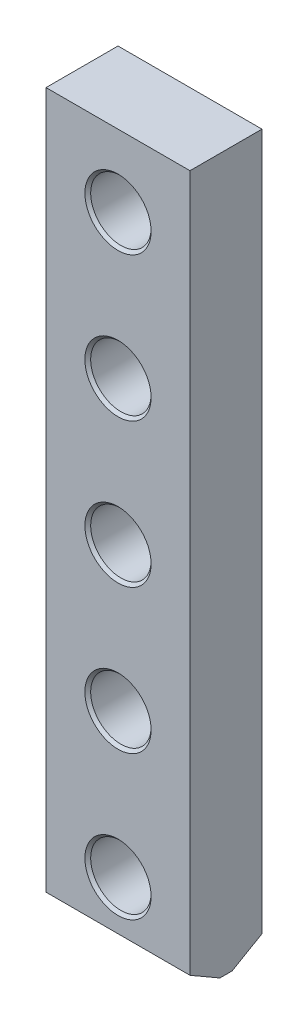
ISO-10303-21;
HEADER;
FILE_DESCRIPTION(('STEP AP214'),'2;1');
FILE_NAME('part.step','',(''),(''),'','','');
FILE_SCHEMA(('AUTOMOTIVE_DESIGN { 1 0 10303 214 1 1 1 1 }'));
ENDSEC;
DATA;
#1=APPLICATION_CONTEXT('core data for automotive mechanical design processes');
#2=APPLICATION_PROTOCOL_DEFINITION('international standard','automotive_design',2000,#1);
#3=PRODUCT_CONTEXT('',#1,'mechanical');
#4=PRODUCT('Part','Part','',(#3));
#5=PRODUCT_RELATED_PRODUCT_CATEGORY('part','',(#4));
#6=PRODUCT_DEFINITION_FORMATION('','',#4);
#7=PRODUCT_DEFINITION_CONTEXT('part definition',#1,'design');
#8=PRODUCT_DEFINITION('design','',#6,#7);
#9=PRODUCT_DEFINITION_SHAPE('','',#8);
#10=(LENGTH_UNIT() NAMED_UNIT(*) SI_UNIT(.MILLI.,.METRE.));
#11=(NAMED_UNIT(*) PLANE_ANGLE_UNIT() SI_UNIT($,.RADIAN.));
#12=(NAMED_UNIT(*) SI_UNIT($,.STERADIAN.) SOLID_ANGLE_UNIT());
#13=UNCERTAINTY_MEASURE_WITH_UNIT(LENGTH_MEASURE(1.E-05),#10,'distance_accuracy_value','');
#14=(GEOMETRIC_REPRESENTATION_CONTEXT(3) GLOBAL_UNCERTAINTY_ASSIGNED_CONTEXT((#13)) GLOBAL_UNIT_ASSIGNED_CONTEXT((#10,
#11,#12)) REPRESENTATION_CONTEXT('',''));
#15=CARTESIAN_POINT('',(0.,0.,0.));
#16=DIRECTION('',(0.,0.,1.));
#17=DIRECTION('',(1.,0.,0.));
#18=AXIS2_PLACEMENT_3D('',#15,#16,#17);
#19=CARTESIAN_POINT('',(0.,0.,25.));
#20=DIRECTION('',(1.,0.,0.));
#21=DIRECTION('',(0.,1.,0.));
#22=AXIS2_PLACEMENT_3D('',#19,#20,#21);
#23=PLANE('',#22);
#24=DIRECTION('',(0.,0.,-1.));
#25=VECTOR('',#24,1.);
#26=CARTESIAN_POINT('',(0.,0.,25.));
#27=LINE('',#26,#25);
#28=CARTESIAN_POINT('',(0.,0.,14.6076951545867));
#29=VERTEX_POINT('',#28);
#30=CARTESIAN_POINT('',(0.,0.,10.3923048454133));
#31=VERTEX_POINT('',#30);
#32=EDGE_CURVE('E371',#29,#31,#27,.T.);
#33=ORIENTED_EDGE('',*,*,#32,.F.);
#34=DIRECTION('',(0.,-0.500000000000002,-0.866025403784437));
#35=VECTOR('',#34,1.);
#36=CARTESIAN_POINT('',(0.,6.00000000000003,25.));
#37=LINE('',#36,#35);
#38=CARTESIAN_POINT('',(0.,6.00000000000003,25.));
#39=VERTEX_POINT('',#38);
#40=EDGE_CURVE('E386',#29,#39,#37,.F.);
#41=ORIENTED_EDGE('',*,*,#40,.T.);
#42=DIRECTION('',(0.,-1.,0.));
#43=VECTOR('',#42,1.);
#44=CARTESIAN_POINT('',(0.,0.,25.));
#45=LINE('',#44,#43);
#46=CARTESIAN_POINT('',(0.,248.,25.));
#47=VERTEX_POINT('',#46);
#48=EDGE_CURVE('E345',#47,#39,#45,.T.);
#49=ORIENTED_EDGE('',*,*,#48,.F.);
#50=DIRECTION('',(0.,0.,-1.));
#51=VECTOR('',#50,1.);
#52=CARTESIAN_POINT('',(0.,248.,25.));
#53=LINE('',#52,#51);
#54=CARTESIAN_POINT('',(0.,248.,0.));
#55=VERTEX_POINT('',#54);
#56=EDGE_CURVE('E355',#47,#55,#53,.T.);
#57=ORIENTED_EDGE('',*,*,#56,.T.);
#58=DIRECTION('',(0.,-1.,0.));
#59=VECTOR('',#58,1.);
#60=CARTESIAN_POINT('',(0.,0.,0.));
#61=LINE('',#60,#59);
#62=CARTESIAN_POINT('',(0.,6.00000000000003,0.));
#63=VERTEX_POINT('',#62);
#64=EDGE_CURVE('E364',#55,#63,#61,.T.);
#65=ORIENTED_EDGE('',*,*,#64,.T.);
#66=DIRECTION('',(0.,-0.500000000000002,0.866025403784437));
#67=VECTOR('',#66,1.);
#68=CARTESIAN_POINT('',(0.,0.,10.3923048454133));
#69=LINE('',#68,#67);
#70=EDGE_CURVE('E380',#63,#31,#69,.T.);
#71=ORIENTED_EDGE('',*,*,#70,.T.);
#72=EDGE_LOOP('',(#33,#41,#49,#57,#65,#71));
#73=FACE_BOUND('',#72,.T.);
#74=ADVANCED_FACE('F284',(#73),#23,.F.);
#75=CARTESIAN_POINT('',(0.,0.,25.));
#76=DIRECTION('',(0.,1.,0.));
#77=DIRECTION('',(-1.,0.,0.));
#78=AXIS2_PLACEMENT_3D('',#75,#76,#77);
#79=PLANE('',#78);
#80=DIRECTION('',(0.,0.,-1.));
#81=VECTOR('',#80,1.);
#82=CARTESIAN_POINT('',(50.0000000000001,0.,25.));
#83=LINE('',#82,#81);
#84=CARTESIAN_POINT('',(50.0000000000001,0.,14.6076951545867));
#85=VERTEX_POINT('',#84);
#86=CARTESIAN_POINT('',(50.0000000000001,0.,10.3923048454133));
#87=VERTEX_POINT('',#86);
#88=EDGE_CURVE('E354',#85,#87,#83,.T.);
#89=ORIENTED_EDGE('',*,*,#88,.F.);
#90=DIRECTION('',(-1.,0.,0.));
#91=VECTOR('',#90,1.);
#92=CARTESIAN_POINT('',(0.,0.,14.6076951545867));
#93=LINE('',#92,#91);
#94=EDGE_CURVE('E299',#85,#29,#93,.T.);
#95=ORIENTED_EDGE('',*,*,#94,.T.);
#96=ORIENTED_EDGE('',*,*,#32,.T.);
#97=DIRECTION('',(1.,0.,0.));
#98=VECTOR('',#97,1.);
#99=CARTESIAN_POINT('',(50.0000000000001,0.,10.3923048454133));
#100=LINE('',#99,#98);
#101=EDGE_CURVE('E373',#31,#87,#100,.T.);
#102=ORIENTED_EDGE('',*,*,#101,.T.);
#103=EDGE_LOOP('',(#89,#95,#96,#102));
#104=FACE_BOUND('',#103,.T.);
#105=ADVANCED_FACE('F471',(#104),#79,.F.);
#106=CARTESIAN_POINT('',(50.0000000000001,0.,25.));
#107=DIRECTION('',(-1.,0.,0.));
#108=DIRECTION('',(0.,-1.,0.));
#109=AXIS2_PLACEMENT_3D('',#106,#107,#108);
#110=PLANE('',#109);
#111=DIRECTION('',(0.,1.,0.));
#112=VECTOR('',#111,1.);
#113=CARTESIAN_POINT('',(50.0000000000001,0.,25.));
#114=LINE('',#113,#112);
#115=CARTESIAN_POINT('',(50.0000000000001,6.00000000000004,25.));
#116=VERTEX_POINT('',#115);
#117=CARTESIAN_POINT('',(50.,248.,25.));
#118=VERTEX_POINT('',#117);
#119=EDGE_CURVE('E336',#116,#118,#114,.T.);
#120=ORIENTED_EDGE('',*,*,#119,.F.);
#121=DIRECTION('',(0.,0.500000000000002,0.866025403784437));
#122=VECTOR('',#121,1.);
#123=CARTESIAN_POINT('',(50.0000000000001,6.00000000000004,25.));
#124=LINE('',#123,#122);
#125=EDGE_CURVE('E307',#116,#85,#124,.F.);
#126=ORIENTED_EDGE('',*,*,#125,.T.);
#127=ORIENTED_EDGE('',*,*,#88,.T.);
#128=DIRECTION('',(0.,0.500000000000002,-0.866025403784437));
#129=VECTOR('',#128,1.);
#130=CARTESIAN_POINT('',(50.0000000000001,0.,10.3923048454133));
#131=LINE('',#130,#129);
#132=CARTESIAN_POINT('',(50.0000000000001,6.00000000000004,0.));
#133=VERTEX_POINT('',#132);
#134=EDGE_CURVE('E376',#87,#133,#131,.T.);
#135=ORIENTED_EDGE('',*,*,#134,.T.);
#136=DIRECTION('',(0.,1.,0.));
#137=VECTOR('',#136,1.);
#138=CARTESIAN_POINT('',(50.0000000000001,0.,0.));
#139=LINE('',#138,#137);
#140=CARTESIAN_POINT('',(50.,248.,0.));
#141=VERTEX_POINT('',#140);
#142=EDGE_CURVE('E351',#133,#141,#139,.T.);
#143=ORIENTED_EDGE('',*,*,#142,.T.);
#144=DIRECTION('',(0.,0.,-1.));
#145=VECTOR('',#144,1.);
#146=CARTESIAN_POINT('',(50.,248.,25.));
#147=LINE('',#146,#145);
#148=EDGE_CURVE('E348',#118,#141,#147,.T.);
#149=ORIENTED_EDGE('',*,*,#148,.F.);
#150=EDGE_LOOP('',(#120,#126,#127,#135,#143,#149));
#151=FACE_BOUND('',#150,.T.);
#152=ADVANCED_FACE('F349',(#151),#110,.F.);
#153=CARTESIAN_POINT('',(0.,248.,25.));
#154=DIRECTION('',(0.,-1.,0.));
#155=DIRECTION('',(0.,0.,-1.));
#156=AXIS2_PLACEMENT_3D('',#153,#154,#155);
#157=PLANE('',#156);
#158=DIRECTION('',(-1.,0.,0.));
#159=VECTOR('',#158,1.);
#160=CARTESIAN_POINT('',(0.,248.,0.));
#161=LINE('',#160,#159);
#162=EDGE_CURVE('E368',#141,#55,#161,.T.);
#163=ORIENTED_EDGE('',*,*,#162,.T.);
#164=ORIENTED_EDGE('',*,*,#56,.F.);
#165=DIRECTION('',(-1.,0.,0.));
#166=VECTOR('',#165,1.);
#167=CARTESIAN_POINT('',(0.,248.,25.));
#168=LINE('',#167,#166);
#169=EDGE_CURVE('E341',#118,#47,#168,.T.);
#170=ORIENTED_EDGE('',*,*,#169,.F.);
#171=ORIENTED_EDGE('',*,*,#148,.T.);
#172=EDGE_LOOP('',(#163,#164,#170,#171));
#173=FACE_BOUND('',#172,.T.);
#174=ADVANCED_FACE('F357',(#173),#157,.F.);
#175=CARTESIAN_POINT('',(0.,0.,25.));
#176=DIRECTION('',(0.,0.,-1.));
#177=DIRECTION('',(-1.,0.,0.));
#178=AXIS2_PLACEMENT_3D('',#175,#176,#177);
#179=PLANE('',#178);
#180=CARTESIAN_POINT('',(25.0000000000001,23.,25.));
#181=DIRECTION('',(0.,0.,-1.));
#182=DIRECTION('',(-1.,0.,0.));
#183=AXIS2_PLACEMENT_3D('',#180,#181,#182);
#184=CIRCLE('',#183,11.5);
#185=CARTESIAN_POINT('',(13.5000000000001,23.,25.));
#186=VERTEX_POINT('',#185);
#187=EDGE_CURVE('E12',#186,#186,#184,.T.);
#188=ORIENTED_EDGE('',*,*,#187,.T.);
#189=EDGE_LOOP('',(#188));
#190=FACE_BOUND('',#189,.T.);
#191=CARTESIAN_POINT('',(25.0000000000001,73.,25.));
#192=DIRECTION('',(0.,0.,-1.));
#193=DIRECTION('',(-1.,0.,0.));
#194=AXIS2_PLACEMENT_3D('',#191,#192,#193);
#195=CIRCLE('',#194,11.5);
#196=CARTESIAN_POINT('',(13.5000000000001,73.,25.));
#197=VERTEX_POINT('',#196);
#198=EDGE_CURVE('E292',#197,#197,#195,.T.);
#199=ORIENTED_EDGE('',*,*,#198,.T.);
#200=EDGE_LOOP('',(#199));
#201=FACE_BOUND('',#200,.T.);
#202=CARTESIAN_POINT('',(25.0000000000001,223.,25.));
#203=DIRECTION('',(0.,0.,-1.));
#204=DIRECTION('',(-1.,0.,0.));
#205=AXIS2_PLACEMENT_3D('',#202,#203,#204);
#206=CIRCLE('',#205,11.5);
#207=CARTESIAN_POINT('',(13.5000000000001,223.,25.));
#208=VERTEX_POINT('',#207);
#209=EDGE_CURVE('E439',#208,#208,#206,.T.);
#210=ORIENTED_EDGE('',*,*,#209,.T.);
#211=EDGE_LOOP('',(#210));
#212=FACE_BOUND('',#211,.T.);
#213=CARTESIAN_POINT('',(25.0000000000001,173.,25.));
#214=DIRECTION('',(0.,0.,-1.));
#215=DIRECTION('',(-1.,0.,0.));
#216=AXIS2_PLACEMENT_3D('',#213,#214,#215);
#217=CIRCLE('',#216,11.5);
#218=CARTESIAN_POINT('',(13.5000000000001,173.,25.));
#219=VERTEX_POINT('',#218);
#220=EDGE_CURVE('E436',#219,#219,#217,.T.);
#221=ORIENTED_EDGE('',*,*,#220,.T.);
#222=EDGE_LOOP('',(#221));
#223=FACE_BOUND('',#222,.T.);
#224=CARTESIAN_POINT('',(25.0000000000001,123.,25.));
#225=DIRECTION('',(0.,0.,-1.));
#226=DIRECTION('',(-1.,0.,0.));
#227=AXIS2_PLACEMENT_3D('',#224,#225,#226);
#228=CIRCLE('',#227,11.5);
#229=CARTESIAN_POINT('',(13.5000000000001,123.,25.));
#230=VERTEX_POINT('',#229);
#231=EDGE_CURVE('E433',#230,#230,#228,.T.);
#232=ORIENTED_EDGE('',*,*,#231,.T.);
#233=EDGE_LOOP('',(#232));
#234=FACE_BOUND('',#233,.T.);
#235=ORIENTED_EDGE('',*,*,#48,.T.);
#236=DIRECTION('',(1.,0.,0.));
#237=VECTOR('',#236,1.);
#238=CARTESIAN_POINT('',(0.,6.00000000000003,25.));
#239=LINE('',#238,#237);
#240=EDGE_CURVE('E344',#39,#116,#239,.T.);
#241=ORIENTED_EDGE('',*,*,#240,.T.);
#242=ORIENTED_EDGE('',*,*,#119,.T.);
#243=ORIENTED_EDGE('',*,*,#169,.T.);
#244=EDGE_LOOP('',(#235,#241,#242,#243));
#245=FACE_BOUND('',#244,.T.);
#246=ADVANCED_FACE('F339',(#190,#201,#212,#223,#234,#245),#179,.F.);
#247=CARTESIAN_POINT('',(0.,0.,0.));
#248=DIRECTION('',(0.,0.,-1.));
#249=DIRECTION('',(-1.,0.,0.));
#250=AXIS2_PLACEMENT_3D('',#247,#248,#249);
#251=PLANE('',#250);
#252=CARTESIAN_POINT('',(25.0000000000001,223.,0.));
#253=DIRECTION('',(0.,0.,-1.));
#254=DIRECTION('',(-1.,0.,0.));
#255=AXIS2_PLACEMENT_3D('',#252,#253,#254);
#256=CIRCLE('',#255,11.5);
#257=CARTESIAN_POINT('',(13.5000000000001,223.,0.));
#258=VERTEX_POINT('',#257);
#259=EDGE_CURVE('E400',#258,#258,#256,.F.);
#260=ORIENTED_EDGE('',*,*,#259,.T.);
#261=EDGE_LOOP('',(#260));
#262=FACE_BOUND('',#261,.T.);
#263=CARTESIAN_POINT('',(25.0000000000001,23.,0.));
#264=DIRECTION('',(0.,0.,-1.));
#265=DIRECTION('',(-1.,0.,0.));
#266=AXIS2_PLACEMENT_3D('',#263,#264,#265);
#267=CIRCLE('',#266,11.5);
#268=CARTESIAN_POINT('',(13.5000000000001,23.,0.));
#269=VERTEX_POINT('',#268);
#270=EDGE_CURVE('E397',#269,#269,#267,.F.);
#271=ORIENTED_EDGE('',*,*,#270,.T.);
#272=EDGE_LOOP('',(#271));
#273=FACE_BOUND('',#272,.T.);
#274=CARTESIAN_POINT('',(25.0000000000001,73.,0.));
#275=DIRECTION('',(0.,0.,-1.));
#276=DIRECTION('',(-1.,0.,0.));
#277=AXIS2_PLACEMENT_3D('',#274,#275,#276);
#278=CIRCLE('',#277,11.5);
#279=CARTESIAN_POINT('',(13.5000000000001,73.,0.));
#280=VERTEX_POINT('',#279);
#281=EDGE_CURVE('E394',#280,#280,#278,.F.);
#282=ORIENTED_EDGE('',*,*,#281,.T.);
#283=EDGE_LOOP('',(#282));
#284=FACE_BOUND('',#283,.T.);
#285=CARTESIAN_POINT('',(25.0000000000001,123.,0.));
#286=DIRECTION('',(0.,0.,-1.));
#287=DIRECTION('',(-1.,0.,0.));
#288=AXIS2_PLACEMENT_3D('',#285,#286,#287);
#289=CIRCLE('',#288,11.5);
#290=CARTESIAN_POINT('',(13.5000000000001,123.,0.));
#291=VERTEX_POINT('',#290);
#292=EDGE_CURVE('E391',#291,#291,#289,.F.);
#293=ORIENTED_EDGE('',*,*,#292,.T.);
#294=EDGE_LOOP('',(#293));
#295=FACE_BOUND('',#294,.T.);
#296=CARTESIAN_POINT('',(25.0000000000001,173.,0.));
#297=DIRECTION('',(0.,0.,-1.));
#298=DIRECTION('',(-1.,0.,0.));
#299=AXIS2_PLACEMENT_3D('',#296,#297,#298);
#300=CIRCLE('',#299,11.5);
#301=CARTESIAN_POINT('',(13.5000000000001,173.,0.));
#302=VERTEX_POINT('',#301);
#303=EDGE_CURVE('E388',#302,#302,#300,.F.);
#304=ORIENTED_EDGE('',*,*,#303,.T.);
#305=EDGE_LOOP('',(#304));
#306=FACE_BOUND('',#305,.T.);
#307=ORIENTED_EDGE('',*,*,#142,.F.);
#308=DIRECTION('',(-1.,0.,0.));
#309=VECTOR('',#308,1.);
#310=CARTESIAN_POINT('',(0.,6.00000000000003,0.));
#311=LINE('',#310,#309);
#312=EDGE_CURVE('E378',#133,#63,#311,.T.);
#313=ORIENTED_EDGE('',*,*,#312,.T.);
#314=ORIENTED_EDGE('',*,*,#64,.F.);
#315=ORIENTED_EDGE('',*,*,#162,.F.);
#316=EDGE_LOOP('',(#307,#313,#314,#315));
#317=FACE_BOUND('',#316,.T.);
#318=ADVANCED_FACE('F532',(#262,#273,#284,#295,#306,#317),#251,.T.);
#319=CARTESIAN_POINT('',(25.0000000000001,23.,0.));
#320=DIRECTION('',(0.,0.,1.));
#321=DIRECTION('',(1.,0.,0.));
#322=AXIS2_PLACEMENT_3D('',#319,#320,#321);
#323=CYLINDRICAL_SURFACE('',#322,10.5);
#324=CARTESIAN_POINT('',(25.0000000000001,23.,0.999999999999999));
#325=DIRECTION('',(0.,0.,-1.));
#326=DIRECTION('',(-1.,0.,0.));
#327=AXIS2_PLACEMENT_3D('',#324,#325,#326);
#328=CIRCLE('',#327,10.5);
#329=CARTESIAN_POINT('',(14.5000000000001,23.,0.999999999999999));
#330=VERTEX_POINT('',#329);
#331=EDGE_CURVE('E412',#330,#330,#328,.T.);
#332=ORIENTED_EDGE('',*,*,#331,.T.);
#333=EDGE_LOOP('',(#332));
#334=FACE_BOUND('',#333,.T.);
#335=CARTESIAN_POINT('',(25.0000000000001,23.,24.));
#336=DIRECTION('',(0.,0.,-1.));
#337=DIRECTION('',(-1.,0.,0.));
#338=AXIS2_PLACEMENT_3D('',#335,#336,#337);
#339=CIRCLE('',#338,10.5);
#340=CARTESIAN_POINT('',(14.5000000000001,23.,24.));
#341=VERTEX_POINT('',#340);
#342=EDGE_CURVE('E409',#341,#341,#339,.F.);
#343=ORIENTED_EDGE('',*,*,#342,.T.);
#344=EDGE_LOOP('',(#343));
#345=FACE_BOUND('',#344,.T.);
#346=ADVANCED_FACE('F526',(#334,#345),#323,.F.);
#347=CARTESIAN_POINT('',(25.0000000000001,223.,0.));
#348=DIRECTION('',(0.,0.,1.));
#349=DIRECTION('',(1.,0.,0.));
#350=AXIS2_PLACEMENT_3D('',#347,#348,#349);
#351=CYLINDRICAL_SURFACE('',#350,10.5);
#352=CARTESIAN_POINT('',(25.0000000000001,223.,0.999999999999971));
#353=DIRECTION('',(0.,0.,-1.));
#354=DIRECTION('',(-1.,0.,0.));
#355=AXIS2_PLACEMENT_3D('',#352,#353,#354);
#356=CIRCLE('',#355,10.5);
#357=CARTESIAN_POINT('',(14.5000000000001,223.,0.999999999999971));
#358=VERTEX_POINT('',#357);
#359=EDGE_CURVE('E406',#358,#358,#356,.T.);
#360=ORIENTED_EDGE('',*,*,#359,.T.);
#361=EDGE_LOOP('',(#360));
#362=FACE_BOUND('',#361,.T.);
#363=CARTESIAN_POINT('',(25.0000000000001,223.,24.));
#364=DIRECTION('',(0.,0.,-1.));
#365=DIRECTION('',(-1.,0.,0.));
#366=AXIS2_PLACEMENT_3D('',#363,#364,#365);
#367=CIRCLE('',#366,10.5);
#368=CARTESIAN_POINT('',(14.5000000000001,223.,24.));
#369=VERTEX_POINT('',#368);
#370=EDGE_CURVE('E403',#369,#369,#367,.F.);
#371=ORIENTED_EDGE('',*,*,#370,.T.);
#372=EDGE_LOOP('',(#371));
#373=FACE_BOUND('',#372,.T.);
#374=ADVANCED_FACE('F520',(#362,#373),#351,.F.);
#375=CARTESIAN_POINT('',(25.0000000000001,173.,0.));
#376=DIRECTION('',(0.,0.,1.));
#377=DIRECTION('',(1.,0.,0.));
#378=AXIS2_PLACEMENT_3D('',#375,#376,#377);
#379=CYLINDRICAL_SURFACE('',#378,10.5);
#380=CARTESIAN_POINT('',(25.0000000000001,173.,0.999999999999971));
#381=DIRECTION('',(0.,0.,-1.));
#382=DIRECTION('',(-1.,0.,0.));
#383=AXIS2_PLACEMENT_3D('',#380,#381,#382);
#384=CIRCLE('',#383,10.5);
#385=CARTESIAN_POINT('',(14.5000000000001,173.,0.999999999999971));
#386=VERTEX_POINT('',#385);
#387=EDGE_CURVE('E430',#386,#386,#384,.T.);
#388=ORIENTED_EDGE('',*,*,#387,.T.);
#389=EDGE_LOOP('',(#388));
#390=FACE_BOUND('',#389,.T.);
#391=CARTESIAN_POINT('',(25.0000000000001,173.,24.));
#392=DIRECTION('',(0.,0.,-1.));
#393=DIRECTION('',(-1.,0.,0.));
#394=AXIS2_PLACEMENT_3D('',#391,#392,#393);
#395=CIRCLE('',#394,10.5);
#396=CARTESIAN_POINT('',(14.5000000000001,173.,24.));
#397=VERTEX_POINT('',#396);
#398=EDGE_CURVE('E427',#397,#397,#395,.F.);
#399=ORIENTED_EDGE('',*,*,#398,.T.);
#400=EDGE_LOOP('',(#399));
#401=FACE_BOUND('',#400,.T.);
#402=ADVANCED_FACE('F467',(#390,#401),#379,.F.);
#403=CARTESIAN_POINT('',(25.0000000000001,123.,0.));
#404=DIRECTION('',(0.,0.,1.));
#405=DIRECTION('',(1.,0.,0.));
#406=AXIS2_PLACEMENT_3D('',#403,#404,#405);
#407=CYLINDRICAL_SURFACE('',#406,10.5);
#408=CARTESIAN_POINT('',(25.0000000000001,123.,0.999999999999971));
#409=DIRECTION('',(0.,0.,-1.));
#410=DIRECTION('',(-1.,0.,0.));
#411=AXIS2_PLACEMENT_3D('',#408,#409,#410);
#412=CIRCLE('',#411,10.5);
#413=CARTESIAN_POINT('',(14.5000000000001,123.,0.999999999999971));
#414=VERTEX_POINT('',#413);
#415=EDGE_CURVE('E424',#414,#414,#412,.T.);
#416=ORIENTED_EDGE('',*,*,#415,.T.);
#417=EDGE_LOOP('',(#416));
#418=FACE_BOUND('',#417,.T.);
#419=CARTESIAN_POINT('',(25.0000000000001,123.,24.));
#420=DIRECTION('',(0.,0.,-1.));
#421=DIRECTION('',(-1.,0.,0.));
#422=AXIS2_PLACEMENT_3D('',#419,#420,#421);
#423=CIRCLE('',#422,10.5);
#424=CARTESIAN_POINT('',(14.5000000000001,123.,24.));
#425=VERTEX_POINT('',#424);
#426=EDGE_CURVE('E421',#425,#425,#423,.F.);
#427=ORIENTED_EDGE('',*,*,#426,.T.);
#428=EDGE_LOOP('',(#427));
#429=FACE_BOUND('',#428,.T.);
#430=ADVANCED_FACE('F457',(#418,#429),#407,.F.);
#431=CARTESIAN_POINT('',(25.0000000000001,73.,0.));
#432=DIRECTION('',(0.,0.,1.));
#433=DIRECTION('',(1.,0.,0.));
#434=AXIS2_PLACEMENT_3D('',#431,#432,#433);
#435=CYLINDRICAL_SURFACE('',#434,10.5);
#436=CARTESIAN_POINT('',(25.0000000000001,73.,0.999999999999977));
#437=DIRECTION('',(0.,0.,-1.));
#438=DIRECTION('',(-1.,0.,0.));
#439=AXIS2_PLACEMENT_3D('',#436,#437,#438);
#440=CIRCLE('',#439,10.5);
#441=CARTESIAN_POINT('',(14.5000000000001,73.,0.999999999999977));
#442=VERTEX_POINT('',#441);
#443=EDGE_CURVE('E418',#442,#442,#440,.T.);
#444=ORIENTED_EDGE('',*,*,#443,.T.);
#445=EDGE_LOOP('',(#444));
#446=FACE_BOUND('',#445,.T.);
#447=CARTESIAN_POINT('',(25.0000000000001,73.,24.));
#448=DIRECTION('',(0.,0.,-1.));
#449=DIRECTION('',(-1.,0.,0.));
#450=AXIS2_PLACEMENT_3D('',#447,#448,#449);
#451=CIRCLE('',#450,10.5);
#452=CARTESIAN_POINT('',(14.5000000000001,73.,24.));
#453=VERTEX_POINT('',#452);
#454=EDGE_CURVE('E415',#453,#453,#451,.F.);
#455=ORIENTED_EDGE('',*,*,#454,.T.);
#456=EDGE_LOOP('',(#455));
#457=FACE_BOUND('',#456,.T.);
#458=ADVANCED_FACE('F454',(#446,#457),#435,.F.);
#459=CARTESIAN_POINT('',(0.,0.,10.3923048454133));
#460=DIRECTION('',(0.,-0.866025403784437,-0.500000000000002));
#461=DIRECTION('',(-1.,0.,0.));
#462=AXIS2_PLACEMENT_3D('',#459,#460,#461);
#463=PLANE('',#462);
#464=ORIENTED_EDGE('',*,*,#70,.F.);
#465=ORIENTED_EDGE('',*,*,#312,.F.);
#466=ORIENTED_EDGE('',*,*,#134,.F.);
#467=ORIENTED_EDGE('',*,*,#101,.F.);
#468=EDGE_LOOP('',(#464,#465,#466,#467));
#469=FACE_BOUND('',#468,.T.);
#470=ADVANCED_FACE('F456',(#469),#463,.T.);
#471=CARTESIAN_POINT('',(0.,6.00000000000003,25.));
#472=DIRECTION('',(0.,0.866025403784437,-0.500000000000002));
#473=DIRECTION('',(1.,0.,0.));
#474=AXIS2_PLACEMENT_3D('',#471,#472,#473);
#475=PLANE('',#474);
#476=ORIENTED_EDGE('',*,*,#40,.F.);
#477=ORIENTED_EDGE('',*,*,#94,.F.);
#478=ORIENTED_EDGE('',*,*,#125,.F.);
#479=ORIENTED_EDGE('',*,*,#240,.F.);
#480=EDGE_LOOP('',(#476,#477,#478,#479));
#481=FACE_BOUND('',#480,.T.);
#482=ADVANCED_FACE('F464',(#481),#475,.F.);
#483=CARTESIAN_POINT('',(25.0000000000001,223.,0.));
#484=DIRECTION('',(0.,0.,-1.));
#485=DIRECTION('',(-1.,0.,0.));
#486=AXIS2_PLACEMENT_3D('',#483,#484,#485);
#487=CONICAL_SURFACE('',#486,11.5,0.785398163397453);
#488=ORIENTED_EDGE('',*,*,#359,.F.);
#489=EDGE_LOOP('',(#488));
#490=FACE_BOUND('',#489,.T.);
#491=ORIENTED_EDGE('',*,*,#259,.F.);
#492=EDGE_LOOP('',(#491));
#493=FACE_BOUND('',#492,.T.);
#494=ADVANCED_FACE('F482',(#490,#493),#487,.F.);
#495=CARTESIAN_POINT('',(25.0000000000001,23.,0.));
#496=DIRECTION('',(0.,0.,-1.));
#497=DIRECTION('',(-1.,0.,0.));
#498=AXIS2_PLACEMENT_3D('',#495,#496,#497);
#499=CONICAL_SURFACE('',#498,11.5,0.785398163397453);
#500=ORIENTED_EDGE('',*,*,#331,.F.);
#501=EDGE_LOOP('',(#500));
#502=FACE_BOUND('',#501,.T.);
#503=ORIENTED_EDGE('',*,*,#270,.F.);
#504=EDGE_LOOP('',(#503));
#505=FACE_BOUND('',#504,.T.);
#506=ADVANCED_FACE('F486',(#502,#505),#499,.F.);
#507=CARTESIAN_POINT('',(25.0000000000001,73.,0.));
#508=DIRECTION('',(0.,0.,-1.));
#509=DIRECTION('',(-1.,0.,0.));
#510=AXIS2_PLACEMENT_3D('',#507,#508,#509);
#511=CONICAL_SURFACE('',#510,11.5,0.785398163397453);
#512=ORIENTED_EDGE('',*,*,#443,.F.);
#513=EDGE_LOOP('',(#512));
#514=FACE_BOUND('',#513,.T.);
#515=ORIENTED_EDGE('',*,*,#281,.F.);
#516=EDGE_LOOP('',(#515));
#517=FACE_BOUND('',#516,.T.);
#518=ADVANCED_FACE('F490',(#514,#517),#511,.F.);
#519=CARTESIAN_POINT('',(25.0000000000001,123.,0.));
#520=DIRECTION('',(0.,0.,-1.));
#521=DIRECTION('',(-1.,0.,0.));
#522=AXIS2_PLACEMENT_3D('',#519,#520,#521);
#523=CONICAL_SURFACE('',#522,11.5,0.785398163397453);
#524=ORIENTED_EDGE('',*,*,#415,.F.);
#525=EDGE_LOOP('',(#524));
#526=FACE_BOUND('',#525,.T.);
#527=ORIENTED_EDGE('',*,*,#292,.F.);
#528=EDGE_LOOP('',(#527));
#529=FACE_BOUND('',#528,.T.);
#530=ADVANCED_FACE('F494',(#526,#529),#523,.F.);
#531=CARTESIAN_POINT('',(25.0000000000001,173.,0.));
#532=DIRECTION('',(0.,0.,-1.));
#533=DIRECTION('',(-1.,0.,0.));
#534=AXIS2_PLACEMENT_3D('',#531,#532,#533);
#535=CONICAL_SURFACE('',#534,11.5,0.785398163397453);
#536=ORIENTED_EDGE('',*,*,#387,.F.);
#537=EDGE_LOOP('',(#536));
#538=FACE_BOUND('',#537,.T.);
#539=ORIENTED_EDGE('',*,*,#303,.F.);
#540=EDGE_LOOP('',(#539));
#541=FACE_BOUND('',#540,.T.);
#542=ADVANCED_FACE('F498',(#538,#541),#535,.F.);
#543=CARTESIAN_POINT('',(25.0000000000001,23.,24.));
#544=DIRECTION('',(0.,0.,1.));
#545=DIRECTION('',(1.,0.,0.));
#546=AXIS2_PLACEMENT_3D('',#543,#544,#545);
#547=CONICAL_SURFACE('',#546,10.5,0.785398163397456);
#548=ORIENTED_EDGE('',*,*,#187,.F.);
#549=EDGE_LOOP('',(#548));
#550=FACE_BOUND('',#549,.T.);
#551=ORIENTED_EDGE('',*,*,#342,.F.);
#552=EDGE_LOOP('',(#551));
#553=FACE_BOUND('',#552,.T.);
#554=ADVANCED_FACE('F450',(#550,#553),#547,.F.);
#555=CARTESIAN_POINT('',(25.0000000000001,73.,24.));
#556=DIRECTION('',(0.,0.,1.));
#557=DIRECTION('',(1.,0.,0.));
#558=AXIS2_PLACEMENT_3D('',#555,#556,#557);
#559=CONICAL_SURFACE('',#558,10.5,0.785398163397444);
#560=ORIENTED_EDGE('',*,*,#198,.F.);
#561=EDGE_LOOP('',(#560));
#562=FACE_BOUND('',#561,.T.);
#563=ORIENTED_EDGE('',*,*,#454,.F.);
#564=EDGE_LOOP('',(#563));
#565=FACE_BOUND('',#564,.T.);
#566=ADVANCED_FACE('F446',(#562,#565),#559,.F.);
#567=CARTESIAN_POINT('',(25.0000000000001,223.,24.));
#568=DIRECTION('',(0.,0.,1.));
#569=DIRECTION('',(1.,0.,0.));
#570=AXIS2_PLACEMENT_3D('',#567,#568,#569);
#571=CONICAL_SURFACE('',#570,10.5,0.785398163397445);
#572=ORIENTED_EDGE('',*,*,#209,.F.);
#573=EDGE_LOOP('',(#572));
#574=FACE_BOUND('',#573,.T.);
#575=ORIENTED_EDGE('',*,*,#370,.F.);
#576=EDGE_LOOP('',(#575));
#577=FACE_BOUND('',#576,.T.);
#578=ADVANCED_FACE('F449',(#574,#577),#571,.F.);
#579=CARTESIAN_POINT('',(25.0000000000001,173.,24.));
#580=DIRECTION('',(0.,0.,1.));
#581=DIRECTION('',(1.,0.,0.));
#582=AXIS2_PLACEMENT_3D('',#579,#580,#581);
#583=CONICAL_SURFACE('',#582,10.5,0.785398163397445);
#584=ORIENTED_EDGE('',*,*,#220,.F.);
#585=EDGE_LOOP('',(#584));
#586=FACE_BOUND('',#585,.T.);
#587=ORIENTED_EDGE('',*,*,#398,.F.);
#588=EDGE_LOOP('',(#587));
#589=FACE_BOUND('',#588,.T.);
#590=ADVANCED_FACE('F507',(#586,#589),#583,.F.);
#591=CARTESIAN_POINT('',(25.0000000000001,123.,24.));
#592=DIRECTION('',(0.,0.,1.));
#593=DIRECTION('',(1.,0.,0.));
#594=AXIS2_PLACEMENT_3D('',#591,#592,#593);
#595=CONICAL_SURFACE('',#594,10.5,0.785398163397445);
#596=ORIENTED_EDGE('',*,*,#231,.F.);
#597=EDGE_LOOP('',(#596));
#598=FACE_BOUND('',#597,.T.);
#599=ORIENTED_EDGE('',*,*,#426,.F.);
#600=EDGE_LOOP('',(#599));
#601=FACE_BOUND('',#600,.T.);
#602=ADVANCED_FACE('F286',(#598,#601),#595,.F.);
#603=CLOSED_SHELL('',(#74,#105,#152,#174,#246,#318,#346,#374,#402,#430,#458,#470,#482,#494,#506,
#518,#530,#542,#554,#566,#578,#590,#602));
#604=MANIFOLD_SOLID_BREP('B2',#603);
#605=ADVANCED_BREP_SHAPE_REPRESENTATION('',(#18,#604),#14);
#606=SHAPE_DEFINITION_REPRESENTATION(#9,#605);
ENDSEC;
END-ISO-10303-21;
